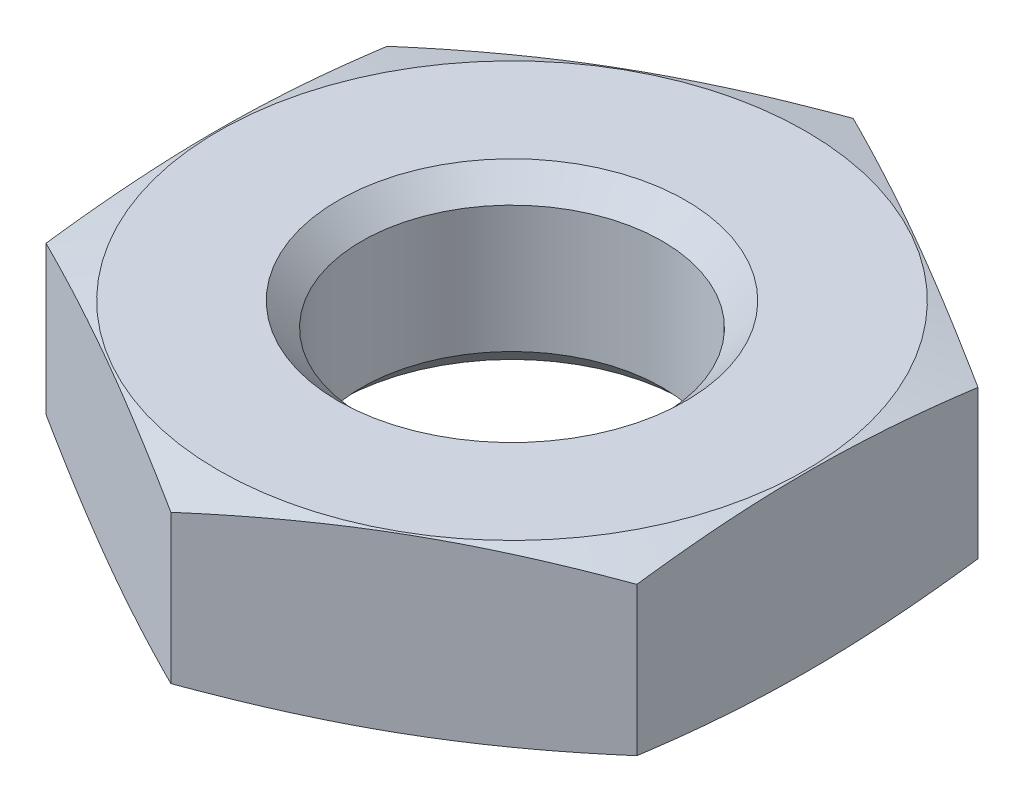
ISO-10303-21;
HEADER;
FILE_DESCRIPTION(('STEP AP214'),'2;1');
FILE_NAME('part.step','',(''),(''),'','','');
FILE_SCHEMA(('AUTOMOTIVE_DESIGN { 1 0 10303 214 1 1 1 1 }'));
ENDSEC;
DATA;
#1=APPLICATION_CONTEXT('core data for automotive mechanical design processes');
#2=APPLICATION_PROTOCOL_DEFINITION('international standard','automotive_design',2000,#1);
#3=PRODUCT_CONTEXT('',#1,'mechanical');
#4=PRODUCT('Part','Part','',(#3));
#5=PRODUCT_RELATED_PRODUCT_CATEGORY('part','',(#4));
#6=PRODUCT_DEFINITION_FORMATION('','',#4);
#7=PRODUCT_DEFINITION_CONTEXT('part definition',#1,'design');
#8=PRODUCT_DEFINITION('design','',#6,#7);
#9=PRODUCT_DEFINITION_SHAPE('','',#8);
#10=(LENGTH_UNIT() NAMED_UNIT(*) SI_UNIT(.MILLI.,.METRE.));
#11=(NAMED_UNIT(*) PLANE_ANGLE_UNIT() SI_UNIT($,.RADIAN.));
#12=(NAMED_UNIT(*) SI_UNIT($,.STERADIAN.) SOLID_ANGLE_UNIT());
#13=UNCERTAINTY_MEASURE_WITH_UNIT(LENGTH_MEASURE(1.E-05),#10,'distance_accuracy_value','');
#14=(GEOMETRIC_REPRESENTATION_CONTEXT(3) GLOBAL_UNCERTAINTY_ASSIGNED_CONTEXT((#13)) GLOBAL_UNIT_ASSIGNED_CONTEXT((#10,
#11,#12)) REPRESENTATION_CONTEXT('',''));
#15=CARTESIAN_POINT('',(0.,0.,0.));
#16=DIRECTION('',(0.,0.,1.));
#17=DIRECTION('',(1.,0.,0.));
#18=AXIS2_PLACEMENT_3D('',#15,#16,#17);
#19=CARTESIAN_POINT('',(0.,0.,0.));
#20=DIRECTION('',(0.,1.,0.));
#21=DIRECTION('',(0.,0.,1.));
#22=AXIS2_PLACEMENT_3D('',#19,#20,#21);
#23=PLANE('',#22);
#24=CARTESIAN_POINT('',(0.,0.,0.));
#25=DIRECTION('',(0.,1.,0.));
#26=DIRECTION('',(0.,0.,1.));
#27=AXIS2_PLACEMENT_3D('',#24,#25,#26);
#28=CIRCLE('',#27,5.);
#29=CARTESIAN_POINT('',(0.,0.,5.));
#30=VERTEX_POINT('',#29);
#31=EDGE_CURVE('E104',#30,#30,#28,.T.);
#32=ORIENTED_EDGE('',*,*,#31,.F.);
#33=EDGE_LOOP('',(#32));
#34=FACE_BOUND('',#33,.T.);
#35=CARTESIAN_POINT('',(0.,0.,0.));
#36=DIRECTION('',(0.,-1.,0.));
#37=DIRECTION('',(0.,0.,-1.));
#38=AXIS2_PLACEMENT_3D('',#35,#36,#37);
#39=CIRCLE('',#38,8.45);
#40=CARTESIAN_POINT('',(0.,0.,-8.45));
#41=VERTEX_POINT('',#40);
#42=EDGE_CURVE('E95',#41,#41,#39,.T.);
#43=ORIENTED_EDGE('',*,*,#42,.F.);
#44=EDGE_LOOP('',(#43));
#45=FACE_BOUND('',#44,.T.);
#46=ADVANCED_FACE('F35',(#34,#45),#23,.T.);
#47=CARTESIAN_POINT('',(0.,-2.5,0.));
#48=DIRECTION('',(0.,-1.,0.));
#49=DIRECTION('',(0.,0.,-1.));
#50=AXIS2_PLACEMENT_3D('',#47,#48,#49);
#51=CONICAL_SURFACE('',#50,17.7801270189222,1.30899693899575);
#52=CARTESIAN_POINT('',(-8.5,-2.36392475448706,15.0360203576042));
#53=CARTESIAN_POINT('',(-8.5,-2.27937012825229,14.6734757623122));
#54=CARTESIAN_POINT('',(-8.5,-2.1954964679628,14.3107707804529));
#55=CARTESIAN_POINT('',(-8.5,-2.02942087737857,13.5849725191365));
#56=CARTESIAN_POINT('',(-8.5,-1.94721897348248,13.2218792336429));
#57=CARTESIAN_POINT('',(-8.5,-1.78478445296958,12.4951814894489));
#58=CARTESIAN_POINT('',(-8.5,-1.70455220114444,12.1315769490498));
#59=CARTESIAN_POINT('',(-8.5,-1.54648067543349,11.4038483267946));
#60=CARTESIAN_POINT('',(-8.5,-1.46864139395056,11.0397242465918));
#61=CARTESIAN_POINT('',(-8.5,-1.31511895411881,10.3073340320132));
#62=CARTESIAN_POINT('',(-8.5,-1.23946401682461,9.93906196641486));
#63=CARTESIAN_POINT('',(-8.5,-1.09175910745214,9.20179613896369));
#64=CARTESIAN_POINT('',(-8.5,-1.01970910749611,8.83280238271482));
#65=CARTESIAN_POINT('',(-8.5,-0.880018719786794,8.09393326140465));
#66=CARTESIAN_POINT('',(-8.5,-0.812378843490313,7.72405779922675));
#67=CARTESIAN_POINT('',(-8.5,-0.682524066993277,6.98335024552976));
#68=CARTESIAN_POINT('',(-8.5,-0.620309164849632,6.61251815435337));
#69=CARTESIAN_POINT('',(-8.5,-0.504138928739045,5.87997045960097));
#70=CARTESIAN_POINT('',(-8.5,-0.450003961095081,5.51828353942055));
#71=CARTESIAN_POINT('',(-8.5,-0.349330847237726,4.79384411222867));
#72=CARTESIAN_POINT('',(-8.5,-0.302792702235554,4.43109160504734));
#73=CARTESIAN_POINT('',(-8.5,-0.218765094679598,3.70462077137004));
#74=CARTESIAN_POINT('',(-8.5,-0.181273351458897,3.34090271172374));
#75=CARTESIAN_POINT('',(-8.5,-0.116770610619291,2.61254160313836));
#76=CARTESIAN_POINT('',(-8.5,-0.0897591451929571,2.24789859621758));
#77=CARTESIAN_POINT('',(-8.5,-0.0475541537350248,1.51956392735028));
#78=CARTESIAN_POINT('',(-8.5,-0.0323080208991868,1.15587536295007));
#79=CARTESIAN_POINT('',(-8.5,-0.0142192230736948,0.428186648910928));
#80=CARTESIAN_POINT('',(-8.5,-0.0113764882642163,0.0641865010374593));
#81=CARTESIAN_POINT('',(-8.5,-0.0182502334673571,-0.66371826942317));
#82=CARTESIAN_POINT('',(-8.5,-0.0279675543871846,-1.02762288398272));
#83=CARTESIAN_POINT('',(-8.5,-0.059441043017621,-1.75489855726966));
#84=CARTESIAN_POINT('',(-8.5,-0.081197199136429,-2.11826961651045));
#85=CARTESIAN_POINT('',(-8.5,-0.147829156542604,-3.00566017974475));
#86=CARTESIAN_POINT('',(-8.5,-0.198684495580304,-3.52923079842504));
#87=CARTESIAN_POINT('',(-8.5,-0.319137315402581,-4.5741303209225));
#88=CARTESIAN_POINT('',(-8.5,-0.388734306057171,-5.0954592830011));
#89=CARTESIAN_POINT('',(-8.5,-0.542670339854262,-6.13767893630393));
#90=CARTESIAN_POINT('',(-8.5,-0.627057752776333,-6.6585623732851));
#91=CARTESIAN_POINT('',(-8.5,-0.806830622464414,-7.69839836943751));
#92=CARTESIAN_POINT('',(-8.5,-0.902215961406582,-8.2173509492331));
#93=CARTESIAN_POINT('',(-8.5,-1.10332786619334,-9.26458573455645));
#94=CARTESIAN_POINT('',(-8.5,-1.20923006614951,-9.79283394970206));
#95=CARTESIAN_POINT('',(-8.5,-1.427471790458,-10.8479976028116));
#96=CARTESIAN_POINT('',(-8.5,-1.53981139317669,-11.374913024469));
#97=CARTESIAN_POINT('',(-8.5,-1.76871242996658,-12.4246853211046));
#98=CARTESIAN_POINT('',(-8.5,-1.88524623727981,-12.9475482412081));
#99=CARTESIAN_POINT('',(-8.5,-2.06282540366483,-13.731191389182));
#100=CARTESIAN_POINT('',(-8.5,-2.12247945448444,-13.9922883452165));
#101=CARTESIAN_POINT('',(-8.5,-2.24261068480916,-14.5142916127147));
#102=CARTESIAN_POINT('',(-8.5,-2.30308786050584,-14.7751979250546));
#103=CARTESIAN_POINT('',(-8.5,-2.36392475448706,-15.0360203576041));
#104=B_SPLINE_CURVE_WITH_KNOTS('',3,(#52,#53,#54,#55,#56,#57,#58,#59,#60,#61,#62,#63,#64,#65,
#66,#67,#68,#69,#70,#71,#72,#73,#74,#75,#76,#77,#78,#79,#80,#81,#82,#83,#84,#85,#86,#87,#88,#89,
#90,#91,#92,#93,#94,#95,#96,#97,#98,#99,#100,#101,#102,#103),.UNSPECIFIED.,.F.,.F.,(4,2,2,2,2,2,
2,2,2,2,2,2,2,2,2,2,2,2,2,2,2,2,2,2,2,4),(0.,1.11682417611697,2.23366597429917,3.35071308134477,
4.46775664166398,5.59563027187189,6.72349517864315,7.85149065587534,8.9794857290864,
10.0765667669557,11.173647979741,12.270452320321,13.3672076972881,14.4590302277838,
15.5508466123061,16.6427360987194,17.7346245337899,19.3122750761973,20.8898843640359,
22.472752670425,24.0556040206808,25.6718286623337,27.2880729834416,28.8951304493105,
29.6986044141634,30.5020746627874),.UNSPECIFIED.);
#105=CARTESIAN_POINT('',(-8.5,-0.365738476404289,4.90747728811182));
#106=VERTEX_POINT('',#105);
#107=CARTESIAN_POINT('',(-8.5,-0.365738476404289,-4.90747728811182));
#108=VERTEX_POINT('',#107);
#109=EDGE_CURVE('E102',#106,#108,#104,.T.);
#110=ORIENTED_EDGE('',*,*,#109,.F.);
#111=CARTESIAN_POINT('',(0.000200000000000405,-0.365769417057962,9.81507004627748));
#112=CARTESIAN_POINT('',(-0.352800229244585,-0.311137500905049,9.61126526889912));
#113=CARTESIAN_POINT('',(-0.706440481475503,-0.261540764749277,9.40709097407731));
#114=CARTESIAN_POINT('',(-1.41496987394528,-0.174403984325095,8.99802133860612));
#115=CARTESIAN_POINT('',(-1.76985946244938,-0.136868837078639,8.79312573915069));
#116=CARTESIAN_POINT('',(-2.47873586595203,-0.0760464794968324,8.38385575676626));
#117=CARTESIAN_POINT('',(-2.83271788769515,-0.0526867370573337,8.17948414122458));
#118=CARTESIAN_POINT('',(-3.5411333400369,-0.0213637164939999,7.77048028911698));
#119=CARTESIAN_POINT('',(-3.89556667001845,-0.0133974596215572,7.56584811064236));
#120=CARTESIAN_POINT('',(-4.60443332998155,-0.0133974596215574,7.15658375369311));
#121=CARTESIAN_POINT('',(-4.9588666599631,-0.0213637164940003,6.95195157521848));
#122=CARTESIAN_POINT('',(-5.66728211230485,-0.0526867370573336,6.54294772311088));
#123=CARTESIAN_POINT('',(-6.02126413404797,-0.0760464794968317,6.33857610756921));
#124=CARTESIAN_POINT('',(-6.73014053755062,-0.136868837078638,5.92930612518478));
#125=CARTESIAN_POINT('',(-7.08503012605472,-0.174403984325094,5.72441052572934));
#126=CARTESIAN_POINT('',(-7.7935595185245,-0.261540764749277,5.31534089025815));
#127=CARTESIAN_POINT('',(-8.14719977075542,-0.311137500905049,5.11116659543634));
#128=CARTESIAN_POINT('',(-8.5002,-0.365769417057961,4.90736181805798));
#129=B_SPLINE_CURVE_WITH_KNOTS('',3,(#111,#112,#113,#114,#115,#116,#117,#118,#119,#120,#121,
#122,#123,#124,#125,#126,#127,#128),.UNSPECIFIED.,.F.,.F.,(4,2,2,2,2,2,2,2,4),(0.,
1.23382789118024,2.46815608714628,3.69611406802288,4.92383440651826,6.15155474501364,
7.37951272589024,8.61384092185628,9.84766881303653),.UNSPECIFIED.);
#130=CARTESIAN_POINT('',(0.,-0.365738476404289,9.81495457622364));
#131=VERTEX_POINT('',#130);
#132=EDGE_CURVE('E139',#131,#106,#129,.T.);
#133=ORIENTED_EDGE('',*,*,#132,.F.);
#134=CARTESIAN_POINT('',(8.5002,-0.365769417057961,4.90736181805798));
#135=CARTESIAN_POINT('',(8.14719977075542,-0.311137500905049,5.11116659543634));
#136=CARTESIAN_POINT('',(7.7935595185245,-0.261540764749276,5.31534089025815));
#137=CARTESIAN_POINT('',(7.08503012605472,-0.174403984325094,5.72441052572934));
#138=CARTESIAN_POINT('',(6.73014053755062,-0.136868837078638,5.92930612518477));
#139=CARTESIAN_POINT('',(6.02126413404797,-0.0760464794968321,6.3385761075692));
#140=CARTESIAN_POINT('',(5.66728211230485,-0.0526867370573339,6.54294772311088));
#141=CARTESIAN_POINT('',(4.9588666599631,-0.021363716494,6.95195157521848));
#142=CARTESIAN_POINT('',(4.60443332998155,-0.0133974596215567,7.15658375369311));
#143=CARTESIAN_POINT('',(3.89556667001845,-0.0133974596215566,7.56584811064235));
#144=CARTESIAN_POINT('',(3.5411333400369,-0.0213637164939999,7.77048028911698));
#145=CARTESIAN_POINT('',(2.83271788769515,-0.0526867370573339,8.17948414122458));
#146=CARTESIAN_POINT('',(2.47873586595203,-0.0760464794968322,8.38385575676626));
#147=CARTESIAN_POINT('',(1.76985946244938,-0.136868837078639,8.79312573915068));
#148=CARTESIAN_POINT('',(1.41496987394528,-0.174403984325095,8.99802133860612));
#149=CARTESIAN_POINT('',(0.706440481475504,-0.261540764749277,9.40709097407731));
#150=CARTESIAN_POINT('',(0.352800229244586,-0.311137500905049,9.61126526889912));
#151=CARTESIAN_POINT('',(-0.000200000000000203,-0.365769417057962,9.81507004627748));
#152=B_SPLINE_CURVE_WITH_KNOTS('',3,(#134,#135,#136,#137,#138,#139,#140,#141,#142,#143,#144,
#145,#146,#147,#148,#149,#150,#151),.UNSPECIFIED.,.F.,.F.,(4,2,2,2,2,2,2,2,4),(0.,
1.23382789118024,2.46815608714628,3.69611406802288,4.92383440651826,6.15155474501364,
7.37951272589024,8.61384092185628,9.84766881303653),.UNSPECIFIED.);
#153=CARTESIAN_POINT('',(8.5,-0.365738476404289,4.90747728811182));
#154=VERTEX_POINT('',#153);
#155=EDGE_CURVE('E146',#154,#131,#152,.T.);
#156=ORIENTED_EDGE('',*,*,#155,.F.);
#157=CARTESIAN_POINT('',(8.5,-2.36392475448706,-15.0360203576042));
#158=CARTESIAN_POINT('',(8.5,-2.27937012825229,-14.6734757623122));
#159=CARTESIAN_POINT('',(8.5,-2.1954964679628,-14.3107707804529));
#160=CARTESIAN_POINT('',(8.5,-2.02942087737857,-13.5849725191365));
#161=CARTESIAN_POINT('',(8.5,-1.94721897348248,-13.2218792336429));
#162=CARTESIAN_POINT('',(8.5,-1.78478445296958,-12.4951814894489));
#163=CARTESIAN_POINT('',(8.5,-1.70455220114444,-12.1315769490498));
#164=CARTESIAN_POINT('',(8.5,-1.54648067543349,-11.4038483267946));
#165=CARTESIAN_POINT('',(8.5,-1.46864139395056,-11.0397242465918));
#166=CARTESIAN_POINT('',(8.5,-1.31511895411881,-10.3073340320132));
#167=CARTESIAN_POINT('',(8.5,-1.23946401682461,-9.93906196641486));
#168=CARTESIAN_POINT('',(8.5,-1.09175910745214,-9.20179613896369));
#169=CARTESIAN_POINT('',(8.5,-1.01970910749611,-8.83280238271482));
#170=CARTESIAN_POINT('',(8.5,-0.880018719786794,-8.09393326140465));
#171=CARTESIAN_POINT('',(8.5,-0.812378843490313,-7.72405779922675));
#172=CARTESIAN_POINT('',(8.5,-0.682524066993277,-6.98335024552976));
#173=CARTESIAN_POINT('',(8.5,-0.620309164849632,-6.61251815435337));
#174=CARTESIAN_POINT('',(8.5,-0.504138928739045,-5.87997045960097));
#175=CARTESIAN_POINT('',(8.5,-0.450003961095081,-5.51828353942055));
#176=CARTESIAN_POINT('',(8.5,-0.349330847237726,-4.79384411222867));
#177=CARTESIAN_POINT('',(8.5,-0.302792702235554,-4.43109160504734));
#178=CARTESIAN_POINT('',(8.5,-0.218765094679598,-3.70462077137004));
#179=CARTESIAN_POINT('',(8.5,-0.181273351458897,-3.34090271172374));
#180=CARTESIAN_POINT('',(8.5,-0.116770610619291,-2.61254160313836));
#181=CARTESIAN_POINT('',(8.5,-0.0897591451929571,-2.24789859621758));
#182=CARTESIAN_POINT('',(8.5,-0.0475541537350248,-1.51956392735028));
#183=CARTESIAN_POINT('',(8.5,-0.0323080208991868,-1.15587536295007));
#184=CARTESIAN_POINT('',(8.5,-0.0142192230736948,-0.428186648910928));
#185=CARTESIAN_POINT('',(8.5,-0.0113764882642163,-0.0641865010374593));
#186=CARTESIAN_POINT('',(8.5,-0.0182502334673571,0.66371826942317));
#187=CARTESIAN_POINT('',(8.5,-0.0279675543871846,1.02762288398272));
#188=CARTESIAN_POINT('',(8.5,-0.059441043017621,1.75489855726966));
#189=CARTESIAN_POINT('',(8.5,-0.081197199136429,2.11826961651045));
#190=CARTESIAN_POINT('',(8.5,-0.147829156542604,3.00566017974475));
#191=CARTESIAN_POINT('',(8.5,-0.198684495580304,3.52923079842504));
#192=CARTESIAN_POINT('',(8.5,-0.319137315402581,4.5741303209225));
#193=CARTESIAN_POINT('',(8.5,-0.388734306057171,5.0954592830011));
#194=CARTESIAN_POINT('',(8.5,-0.542670339854262,6.13767893630393));
#195=CARTESIAN_POINT('',(8.5,-0.627057752776333,6.6585623732851));
#196=CARTESIAN_POINT('',(8.5,-0.806830622464414,7.69839836943751));
#197=CARTESIAN_POINT('',(8.5,-0.902215961406582,8.2173509492331));
#198=CARTESIAN_POINT('',(8.5,-1.10332786619334,9.26458573455645));
#199=CARTESIAN_POINT('',(8.5,-1.20923006614951,9.79283394970206));
#200=CARTESIAN_POINT('',(8.5,-1.427471790458,10.8479976028116));
#201=CARTESIAN_POINT('',(8.5,-1.53981139317669,11.374913024469));
#202=CARTESIAN_POINT('',(8.5,-1.76871242996658,12.4246853211046));
#203=CARTESIAN_POINT('',(8.5,-1.88524623727981,12.9475482412081));
#204=CARTESIAN_POINT('',(8.5,-2.06282540366483,13.731191389182));
#205=CARTESIAN_POINT('',(8.5,-2.12247945448444,13.9922883452165));
#206=CARTESIAN_POINT('',(8.5,-2.24261068480916,14.5142916127147));
#207=CARTESIAN_POINT('',(8.5,-2.30308786050584,14.7751979250546));
#208=CARTESIAN_POINT('',(8.5,-2.36392475448706,15.0360203576041));
#209=B_SPLINE_CURVE_WITH_KNOTS('',3,(#157,#158,#159,#160,#161,#162,#163,#164,#165,#166,#167,
#168,#169,#170,#171,#172,#173,#174,#175,#176,#177,#178,#179,#180,#181,#182,#183,#184,#185,#186,
#187,#188,#189,#190,#191,#192,#193,#194,#195,#196,#197,#198,#199,#200,#201,#202,#203,#204,#205,
#206,#207,#208),.UNSPECIFIED.,.F.,.F.,(4,2,2,2,2,2,2,2,2,2,2,2,2,2,2,2,2,2,2,2,2,2,2,2,2,4),(0.,
1.11682417611697,2.23366597429917,3.35071308134477,4.46775664166398,5.59563027187189,
6.72349517864315,7.85149065587534,8.9794857290864,10.0765667669557,11.173647979741,
12.270452320321,13.3672076972881,14.4590302277838,15.5508466123061,16.6427360987194,
17.7346245337899,19.3122750761973,20.8898843640359,22.472752670425,24.0556040206808,
25.6718286623337,27.2880729834416,28.8951304493105,29.6986044141634,30.5020746627874),.UNSPECIFIED.);
#210=CARTESIAN_POINT('',(8.5,-0.365738476404289,-4.90747728811182));
#211=VERTEX_POINT('',#210);
#212=EDGE_CURVE('E181',#211,#154,#209,.T.);
#213=ORIENTED_EDGE('',*,*,#212,.F.);
#214=CARTESIAN_POINT('',(-0.000200000000000405,-0.365769417057962,-9.81507004627748));
#215=CARTESIAN_POINT('',(0.352800229244585,-0.311137500905049,-9.61126526889912));
#216=CARTESIAN_POINT('',(0.706440481475503,-0.261540764749277,-9.40709097407731));
#217=CARTESIAN_POINT('',(1.41496987394528,-0.174403984325095,-8.99802133860612));
#218=CARTESIAN_POINT('',(1.76985946244938,-0.136868837078639,-8.79312573915069));
#219=CARTESIAN_POINT('',(2.47873586595203,-0.0760464794968324,-8.38385575676626));
#220=CARTESIAN_POINT('',(2.83271788769515,-0.0526867370573337,-8.17948414122458));
#221=CARTESIAN_POINT('',(3.5411333400369,-0.0213637164939999,-7.77048028911698));
#222=CARTESIAN_POINT('',(3.89556667001845,-0.0133974596215572,-7.56584811064236));
#223=CARTESIAN_POINT('',(4.60443332998155,-0.0133974596215574,-7.15658375369311));
#224=CARTESIAN_POINT('',(4.9588666599631,-0.0213637164940003,-6.95195157521848));
#225=CARTESIAN_POINT('',(5.66728211230485,-0.0526867370573336,-6.54294772311088));
#226=CARTESIAN_POINT('',(6.02126413404797,-0.0760464794968317,-6.33857610756921));
#227=CARTESIAN_POINT('',(6.73014053755062,-0.136868837078638,-5.92930612518478));
#228=CARTESIAN_POINT('',(7.08503012605472,-0.174403984325094,-5.72441052572934));
#229=CARTESIAN_POINT('',(7.7935595185245,-0.261540764749277,-5.31534089025815));
#230=CARTESIAN_POINT('',(8.14719977075542,-0.311137500905049,-5.11116659543634));
#231=CARTESIAN_POINT('',(8.5002,-0.365769417057961,-4.90736181805798));
#232=B_SPLINE_CURVE_WITH_KNOTS('',3,(#214,#215,#216,#217,#218,#219,#220,#221,#222,#223,#224,
#225,#226,#227,#228,#229,#230,#231),.UNSPECIFIED.,.F.,.F.,(4,2,2,2,2,2,2,2,4),(0.,
1.23382789118024,2.46815608714628,3.69611406802288,4.92383440651826,6.15155474501364,
7.37951272589024,8.61384092185628,9.84766881303653),.UNSPECIFIED.);
#233=CARTESIAN_POINT('',(0.,-0.365738476404289,-9.81495457622364));
#234=VERTEX_POINT('',#233);
#235=EDGE_CURVE('E174',#234,#211,#232,.T.);
#236=ORIENTED_EDGE('',*,*,#235,.F.);
#237=CARTESIAN_POINT('',(-8.5002,-0.365769417057961,-4.90736181805798));
#238=CARTESIAN_POINT('',(-8.14719977075542,-0.311137500905049,-5.11116659543634));
#239=CARTESIAN_POINT('',(-7.7935595185245,-0.261540764749276,-5.31534089025815));
#240=CARTESIAN_POINT('',(-7.08503012605472,-0.174403984325094,-5.72441052572934));
#241=CARTESIAN_POINT('',(-6.73014053755062,-0.136868837078638,-5.92930612518477));
#242=CARTESIAN_POINT('',(-6.02126413404797,-0.0760464794968321,-6.3385761075692));
#243=CARTESIAN_POINT('',(-5.66728211230485,-0.0526867370573339,-6.54294772311088));
#244=CARTESIAN_POINT('',(-4.9588666599631,-0.021363716494,-6.95195157521848));
#245=CARTESIAN_POINT('',(-4.60443332998155,-0.0133974596215567,-7.15658375369311));
#246=CARTESIAN_POINT('',(-3.89556667001845,-0.0133974596215566,-7.56584811064235));
#247=CARTESIAN_POINT('',(-3.5411333400369,-0.0213637164939999,-7.77048028911698));
#248=CARTESIAN_POINT('',(-2.83271788769515,-0.0526867370573339,-8.17948414122458));
#249=CARTESIAN_POINT('',(-2.47873586595203,-0.0760464794968322,-8.38385575676626));
#250=CARTESIAN_POINT('',(-1.76985946244938,-0.136868837078639,-8.79312573915068));
#251=CARTESIAN_POINT('',(-1.41496987394528,-0.174403984325095,-8.99802133860612));
#252=CARTESIAN_POINT('',(-0.706440481475504,-0.261540764749277,-9.40709097407731));
#253=CARTESIAN_POINT('',(-0.352800229244586,-0.311137500905049,-9.61126526889912));
#254=CARTESIAN_POINT('',(0.000200000000000203,-0.365769417057962,-9.81507004627748));
#255=B_SPLINE_CURVE_WITH_KNOTS('',3,(#237,#238,#239,#240,#241,#242,#243,#244,#245,#246,#247,
#248,#249,#250,#251,#252,#253,#254),.UNSPECIFIED.,.F.,.F.,(4,2,2,2,2,2,2,2,4),(0.,
1.23382789118024,2.46815608714628,3.69611406802288,4.92383440651826,6.15155474501364,
7.37951272589024,8.61384092185628,9.84766881303653),.UNSPECIFIED.);
#256=EDGE_CURVE('E164',#108,#234,#255,.T.);
#257=ORIENTED_EDGE('',*,*,#256,.F.);
#258=EDGE_LOOP('',(#110,#133,#156,#213,#236,#257));
#259=FACE_BOUND('',#258,.T.);
#260=ORIENTED_EDGE('',*,*,#42,.T.);
#261=EDGE_LOOP('',(#260));
#262=FACE_BOUND('',#261,.T.);
#263=ADVANCED_FACE('F157',(#259,#262),#51,.T.);
#264=CARTESIAN_POINT('',(-8.5,6.,-4.90747728811182));
#265=DIRECTION('',(1.,0.,0.));
#266=DIRECTION('',(0.,0.,-1.));
#267=AXIS2_PLACEMENT_3D('',#264,#265,#266);
#268=PLANE('',#267);
#269=ORIENTED_EDGE('',*,*,#109,.T.);
#270=DIRECTION('',(0.,-1.,0.));
#271=VECTOR('',#270,1.);
#272=CARTESIAN_POINT('',(-8.5,6.,-4.90747728811182));
#273=LINE('',#272,#271);
#274=CARTESIAN_POINT('',(-8.5,-4.63426152359571,-4.90747728811182));
#275=VERTEX_POINT('',#274);
#276=EDGE_CURVE('E55',#108,#275,#273,.T.);
#277=ORIENTED_EDGE('',*,*,#276,.T.);
#278=CARTESIAN_POINT('',(-8.5,-2.63607524551294,-15.0360203576042));
#279=CARTESIAN_POINT('',(-8.5,-2.72062987174771,-14.6734757623122));
#280=CARTESIAN_POINT('',(-8.5,-2.8045035320372,-14.3107707804529));
#281=CARTESIAN_POINT('',(-8.5,-2.97057912262143,-13.5849725191365));
#282=CARTESIAN_POINT('',(-8.5,-3.05278102651752,-13.2218792336429));
#283=CARTESIAN_POINT('',(-8.5,-3.21521554703042,-12.4951814894489));
#284=CARTESIAN_POINT('',(-8.5,-3.29544779885556,-12.1315769490498));
#285=CARTESIAN_POINT('',(-8.5,-3.45351932456651,-11.4038483267946));
#286=CARTESIAN_POINT('',(-8.5,-3.53135860604944,-11.0397242465918));
#287=CARTESIAN_POINT('',(-8.5,-3.68488104588119,-10.3073340320132));
#288=CARTESIAN_POINT('',(-8.5,-3.76053598317539,-9.93906196641486));
#289=CARTESIAN_POINT('',(-8.5,-3.90824089254787,-9.20179613896369));
#290=CARTESIAN_POINT('',(-8.5,-3.98029089250389,-8.83280238271482));
#291=CARTESIAN_POINT('',(-8.5,-4.1199812802132,-8.09393326140466));
#292=CARTESIAN_POINT('',(-8.5,-4.18762115650969,-7.72405779922675));
#293=CARTESIAN_POINT('',(-8.5,-4.31747593300672,-6.98335024552976));
#294=CARTESIAN_POINT('',(-8.5,-4.37969083515037,-6.61251815435337));
#295=CARTESIAN_POINT('',(-8.5,-4.49586107126096,-5.87997045960097));
#296=CARTESIAN_POINT('',(-8.5,-4.54999603890492,-5.51828353942055));
#297=CARTESIAN_POINT('',(-8.5,-4.65066915276227,-4.79384411222867));
#298=CARTESIAN_POINT('',(-8.5,-4.69720729776445,-4.43109160504734));
#299=CARTESIAN_POINT('',(-8.5,-4.7812349053204,-3.70462077137004));
#300=CARTESIAN_POINT('',(-8.5,-4.8187266485411,-3.34090271172374));
#301=CARTESIAN_POINT('',(-8.5,-4.88322938938071,-2.61254160313836));
#302=CARTESIAN_POINT('',(-8.5,-4.91024085480704,-2.24789859621759));
#303=CARTESIAN_POINT('',(-8.5,-4.95244584626498,-1.51956392735028));
#304=CARTESIAN_POINT('',(-8.5,-4.96769197910081,-1.15587536295007));
#305=CARTESIAN_POINT('',(-8.5,-4.98578077692631,-0.428186648910928));
#306=CARTESIAN_POINT('',(-8.5,-4.98862351173578,-0.0641865010374597));
#307=CARTESIAN_POINT('',(-8.5,-4.98174976653264,0.66371826942317));
#308=CARTESIAN_POINT('',(-8.5,-4.97203244561282,1.02762288398272));
#309=CARTESIAN_POINT('',(-8.5,-4.94055895698238,1.75489855726966));
#310=CARTESIAN_POINT('',(-8.5,-4.91880280086357,2.11826961651045));
#311=CARTESIAN_POINT('',(-8.5,-4.8521708434574,3.00566017974475));
#312=CARTESIAN_POINT('',(-8.5,-4.8013155044197,3.52923079842504));
#313=CARTESIAN_POINT('',(-8.5,-4.68086268459742,4.5741303209225));
#314=CARTESIAN_POINT('',(-8.5,-4.61126569394283,5.0954592830011));
#315=CARTESIAN_POINT('',(-8.5,-4.45732966014574,6.13767893630393));
#316=CARTESIAN_POINT('',(-8.5,-4.37294224722367,6.6585623732851));
#317=CARTESIAN_POINT('',(-8.5,-4.19316937753559,7.69839836943752));
#318=CARTESIAN_POINT('',(-8.5,-4.09778403859342,8.2173509492331));
#319=CARTESIAN_POINT('',(-8.5,-3.89667213380666,9.26458573455645));
#320=CARTESIAN_POINT('',(-8.5,-3.79076993385049,9.79283394970206));
#321=CARTESIAN_POINT('',(-8.5,-3.572528209542,10.8479976028116));
#322=CARTESIAN_POINT('',(-8.5,-3.46018860682331,11.374913024469));
#323=CARTESIAN_POINT('',(-8.5,-3.23128757003342,12.4246853211046));
#324=CARTESIAN_POINT('',(-8.5,-3.11475376272019,12.9475482412081));
#325=CARTESIAN_POINT('',(-8.5,-2.93717459633517,13.731191389182));
#326=CARTESIAN_POINT('',(-8.5,-2.87752054551556,13.9922883452165));
#327=CARTESIAN_POINT('',(-8.5,-2.75738931519084,14.5142916127147));
#328=CARTESIAN_POINT('',(-8.5,-2.69691213949416,14.7751979250546));
#329=CARTESIAN_POINT('',(-8.5,-2.63607524551294,15.0360203576041));
#330=B_SPLINE_CURVE_WITH_KNOTS('',3,(#278,#279,#280,#281,#282,#283,#284,#285,#286,#287,#288,
#289,#290,#291,#292,#293,#294,#295,#296,#297,#298,#299,#300,#301,#302,#303,#304,#305,#306,#307,
#308,#309,#310,#311,#312,#313,#314,#315,#316,#317,#318,#319,#320,#321,#322,#323,#324,#325,#326,
#327,#328,#329),.UNSPECIFIED.,.F.,.F.,(4,2,2,2,2,2,2,2,2,2,2,2,2,2,2,2,2,2,2,2,2,2,2,2,2,4),(0.,
1.11682417611697,2.23366597429917,3.35071308134477,4.46775664166398,5.59563027187189,
6.72349517864315,7.85149065587534,8.9794857290864,10.0765667669557,11.173647979741,
12.270452320321,13.3672076972881,14.4590302277838,15.5508466123061,16.6427360987194,
17.7346245337899,19.3122750761973,20.8898843640359,22.472752670425,24.0556040206808,
25.6718286623337,27.2880729834416,28.8951304493105,29.6986044141634,30.5020746627874),.UNSPECIFIED.);
#331=CARTESIAN_POINT('',(-8.5,-4.63426152359571,4.90747728811182));
#332=VERTEX_POINT('',#331);
#333=EDGE_CURVE('E11',#275,#332,#330,.T.);
#334=ORIENTED_EDGE('',*,*,#333,.T.);
#335=DIRECTION('',(0.,-1.,0.));
#336=VECTOR('',#335,1.);
#337=CARTESIAN_POINT('',(-8.5,6.,4.90747728811182));
#338=LINE('',#337,#336);
#339=EDGE_CURVE('E267',#106,#332,#338,.T.);
#340=ORIENTED_EDGE('',*,*,#339,.F.);
#341=EDGE_LOOP('',(#269,#277,#334,#340));
#342=FACE_BOUND('',#341,.T.);
#343=ADVANCED_FACE('F98',(#342),#268,.F.);
#344=CARTESIAN_POINT('',(-8.5,6.,4.90747728811182));
#345=DIRECTION('',(0.5,0.,-0.866025403784438));
#346=DIRECTION('',(-0.866025403784439,0.,-0.5));
#347=AXIS2_PLACEMENT_3D('',#344,#345,#346);
#348=PLANE('',#347);
#349=ORIENTED_EDGE('',*,*,#132,.T.);
#350=ORIENTED_EDGE('',*,*,#339,.T.);
#351=CARTESIAN_POINT('',(-8.5002,-4.63423058294204,4.90736181805798));
#352=CARTESIAN_POINT('',(-8.14719977075542,-4.68886249909495,5.11116659543634));
#353=CARTESIAN_POINT('',(-7.7935595185245,-4.73845923525072,5.31534089025815));
#354=CARTESIAN_POINT('',(-7.08503012605472,-4.82559601567491,5.72441052572934));
#355=CARTESIAN_POINT('',(-6.73014053755062,-4.86313116292136,5.92930612518478));
#356=CARTESIAN_POINT('',(-6.02126413404797,-4.92395352050317,6.33857610756921));
#357=CARTESIAN_POINT('',(-5.66728211230485,-4.94731326294267,6.54294772311088));
#358=CARTESIAN_POINT('',(-4.9588666599631,-4.978636283506,6.95195157521848));
#359=CARTESIAN_POINT('',(-4.60443332998155,-4.98660254037844,7.15658375369311));
#360=CARTESIAN_POINT('',(-3.89556667001845,-4.98660254037844,7.56584811064236));
#361=CARTESIAN_POINT('',(-3.5411333400369,-4.978636283506,7.77048028911698));
#362=CARTESIAN_POINT('',(-2.83271788769515,-4.94731326294267,8.17948414122458));
#363=CARTESIAN_POINT('',(-2.47873586595203,-4.92395352050317,8.38385575676626));
#364=CARTESIAN_POINT('',(-1.76985946244938,-4.86313116292136,8.79312573915069));
#365=CARTESIAN_POINT('',(-1.41496987394528,-4.82559601567491,8.99802133860612));
#366=CARTESIAN_POINT('',(-0.706440481475502,-4.73845923525072,9.40709097407731));
#367=CARTESIAN_POINT('',(-0.352800229244585,-4.68886249909495,9.61126526889912));
#368=CARTESIAN_POINT('',(0.000200000000001252,-4.63423058294204,9.81507004627748));
#369=B_SPLINE_CURVE_WITH_KNOTS('',3,(#351,#352,#353,#354,#355,#356,#357,#358,#359,#360,#361,
#362,#363,#364,#365,#366,#367,#368),.UNSPECIFIED.,.F.,.F.,(4,2,2,2,2,2,2,2,4),(0.,
1.23382789118024,2.46815608714628,3.69611406802289,4.92383440651826,6.15155474501364,
7.37951272589024,8.61384092185628,9.84766881303653),.UNSPECIFIED.);
#370=CARTESIAN_POINT('',(0.,-4.63426152359571,9.81495457622364));
#371=VERTEX_POINT('',#370);
#372=EDGE_CURVE('E48',#332,#371,#369,.T.);
#373=ORIENTED_EDGE('',*,*,#372,.T.);
#374=DIRECTION('',(0.,-1.,0.));
#375=VECTOR('',#374,1.);
#376=CARTESIAN_POINT('',(0.,6.,9.81495457622364));
#377=LINE('',#376,#375);
#378=EDGE_CURVE('E266',#131,#371,#377,.T.);
#379=ORIENTED_EDGE('',*,*,#378,.F.);
#380=EDGE_LOOP('',(#349,#350,#373,#379));
#381=FACE_BOUND('',#380,.T.);
#382=ADVANCED_FACE('F130',(#381),#348,.F.);
#383=CARTESIAN_POINT('',(0.,6.,9.81495457622364));
#384=DIRECTION('',(-0.5,0.,-0.866025403784438));
#385=DIRECTION('',(-0.866025403784439,0.,0.5));
#386=AXIS2_PLACEMENT_3D('',#383,#384,#385);
#387=PLANE('',#386);
#388=ORIENTED_EDGE('',*,*,#155,.T.);
#389=ORIENTED_EDGE('',*,*,#378,.T.);
#390=CARTESIAN_POINT('',(-0.00020000000000009,-4.63423058294204,9.81507004627748));
#391=CARTESIAN_POINT('',(0.352800229244587,-4.68886249909495,9.61126526889912));
#392=CARTESIAN_POINT('',(0.706440481475503,-4.73845923525072,9.40709097407731));
#393=CARTESIAN_POINT('',(1.41496987394528,-4.82559601567491,8.99802133860612));
#394=CARTESIAN_POINT('',(1.76985946244938,-4.86313116292136,8.79312573915068));
#395=CARTESIAN_POINT('',(2.47873586595203,-4.92395352050317,8.38385575676626));
#396=CARTESIAN_POINT('',(2.83271788769515,-4.94731326294267,8.17948414122458));
#397=CARTESIAN_POINT('',(3.5411333400369,-4.978636283506,7.77048028911698));
#398=CARTESIAN_POINT('',(3.89556667001845,-4.98660254037844,7.56584811064236));
#399=CARTESIAN_POINT('',(4.60443332998155,-4.98660254037844,7.15658375369311));
#400=CARTESIAN_POINT('',(4.9588666599631,-4.978636283506,6.95195157521848));
#401=CARTESIAN_POINT('',(5.66728211230485,-4.94731326294267,6.54294772311088));
#402=CARTESIAN_POINT('',(6.02126413404797,-4.92395352050317,6.3385761075692));
#403=CARTESIAN_POINT('',(6.73014053755062,-4.86313116292136,5.92930612518477));
#404=CARTESIAN_POINT('',(7.08503012605472,-4.82559601567491,5.72441052572934));
#405=CARTESIAN_POINT('',(7.7935595185245,-4.73845923525072,5.31534089025815));
#406=CARTESIAN_POINT('',(8.14719977075542,-4.68886249909495,5.11116659543634));
#407=CARTESIAN_POINT('',(8.5002,-4.63423058294204,4.90736181805798));
#408=B_SPLINE_CURVE_WITH_KNOTS('',3,(#390,#391,#392,#393,#394,#395,#396,#397,#398,#399,#400,
#401,#402,#403,#404,#405,#406,#407),.UNSPECIFIED.,.F.,.F.,(4,2,2,2,2,2,2,2,4),(0.,
1.23382789118024,2.46815608714628,3.69611406802288,4.92383440651826,6.15155474501364,
7.37951272589024,8.61384092185629,9.84766881303653),.UNSPECIFIED.);
#409=CARTESIAN_POINT('',(8.5,-4.63426152359571,4.90747728811182));
#410=VERTEX_POINT('',#409);
#411=EDGE_CURVE('E111',#371,#410,#408,.T.);
#412=ORIENTED_EDGE('',*,*,#411,.T.);
#413=DIRECTION('',(0.,-1.,0.));
#414=VECTOR('',#413,1.);
#415=CARTESIAN_POINT('',(8.5,6.,4.90747728811182));
#416=LINE('',#415,#414);
#417=EDGE_CURVE('E263',#154,#410,#416,.T.);
#418=ORIENTED_EDGE('',*,*,#417,.F.);
#419=EDGE_LOOP('',(#388,#389,#412,#418));
#420=FACE_BOUND('',#419,.T.);
#421=ADVANCED_FACE('F133',(#420),#387,.F.);
#422=CARTESIAN_POINT('',(8.5,6.,4.90747728811182));
#423=DIRECTION('',(-1.,0.,0.));
#424=DIRECTION('',(0.,0.,1.));
#425=AXIS2_PLACEMENT_3D('',#422,#423,#424);
#426=PLANE('',#425);
#427=ORIENTED_EDGE('',*,*,#212,.T.);
#428=ORIENTED_EDGE('',*,*,#417,.T.);
#429=CARTESIAN_POINT('',(8.5,-2.63607524551294,15.0360203576042));
#430=CARTESIAN_POINT('',(8.5,-2.72062987174771,14.6734757623122));
#431=CARTESIAN_POINT('',(8.5,-2.8045035320372,14.3107707804529));
#432=CARTESIAN_POINT('',(8.5,-2.97057912262143,13.5849725191365));
#433=CARTESIAN_POINT('',(8.5,-3.05278102651752,13.2218792336429));
#434=CARTESIAN_POINT('',(8.5,-3.21521554703042,12.4951814894489));
#435=CARTESIAN_POINT('',(8.5,-3.29544779885556,12.1315769490498));
#436=CARTESIAN_POINT('',(8.5,-3.45351932456651,11.4038483267946));
#437=CARTESIAN_POINT('',(8.5,-3.53135860604944,11.0397242465918));
#438=CARTESIAN_POINT('',(8.5,-3.68488104588119,10.3073340320132));
#439=CARTESIAN_POINT('',(8.5,-3.76053598317539,9.93906196641486));
#440=CARTESIAN_POINT('',(8.5,-3.90824089254787,9.20179613896369));
#441=CARTESIAN_POINT('',(8.5,-3.98029089250389,8.83280238271482));
#442=CARTESIAN_POINT('',(8.5,-4.1199812802132,8.09393326140466));
#443=CARTESIAN_POINT('',(8.5,-4.18762115650969,7.72405779922675));
#444=CARTESIAN_POINT('',(8.5,-4.31747593300672,6.98335024552976));
#445=CARTESIAN_POINT('',(8.5,-4.37969083515037,6.61251815435337));
#446=CARTESIAN_POINT('',(8.5,-4.49586107126096,5.87997045960097));
#447=CARTESIAN_POINT('',(8.5,-4.54999603890492,5.51828353942055));
#448=CARTESIAN_POINT('',(8.5,-4.65066915276227,4.79384411222867));
#449=CARTESIAN_POINT('',(8.5,-4.69720729776445,4.43109160504734));
#450=CARTESIAN_POINT('',(8.5,-4.7812349053204,3.70462077137004));
#451=CARTESIAN_POINT('',(8.5,-4.8187266485411,3.34090271172374));
#452=CARTESIAN_POINT('',(8.5,-4.88322938938071,2.61254160313836));
#453=CARTESIAN_POINT('',(8.5,-4.91024085480704,2.24789859621759));
#454=CARTESIAN_POINT('',(8.5,-4.95244584626498,1.51956392735028));
#455=CARTESIAN_POINT('',(8.5,-4.96769197910081,1.15587536295007));
#456=CARTESIAN_POINT('',(8.5,-4.98578077692631,0.428186648910928));
#457=CARTESIAN_POINT('',(8.5,-4.98862351173578,0.0641865010374597));
#458=CARTESIAN_POINT('',(8.5,-4.98174976653264,-0.66371826942317));
#459=CARTESIAN_POINT('',(8.5,-4.97203244561282,-1.02762288398272));
#460=CARTESIAN_POINT('',(8.5,-4.94055895698238,-1.75489855726966));
#461=CARTESIAN_POINT('',(8.5,-4.91880280086357,-2.11826961651045));
#462=CARTESIAN_POINT('',(8.5,-4.8521708434574,-3.00566017974475));
#463=CARTESIAN_POINT('',(8.5,-4.8013155044197,-3.52923079842504));
#464=CARTESIAN_POINT('',(8.5,-4.68086268459742,-4.5741303209225));
#465=CARTESIAN_POINT('',(8.5,-4.61126569394283,-5.0954592830011));
#466=CARTESIAN_POINT('',(8.5,-4.45732966014574,-6.13767893630393));
#467=CARTESIAN_POINT('',(8.5,-4.37294224722367,-6.6585623732851));
#468=CARTESIAN_POINT('',(8.5,-4.19316937753559,-7.69839836943752));
#469=CARTESIAN_POINT('',(8.5,-4.09778403859342,-8.2173509492331));
#470=CARTESIAN_POINT('',(8.5,-3.89667213380666,-9.26458573455645));
#471=CARTESIAN_POINT('',(8.5,-3.79076993385049,-9.79283394970206));
#472=CARTESIAN_POINT('',(8.5,-3.572528209542,-10.8479976028116));
#473=CARTESIAN_POINT('',(8.5,-3.46018860682331,-11.374913024469));
#474=CARTESIAN_POINT('',(8.5,-3.23128757003342,-12.4246853211046));
#475=CARTESIAN_POINT('',(8.5,-3.11475376272019,-12.9475482412081));
#476=CARTESIAN_POINT('',(8.5,-2.93717459633517,-13.731191389182));
#477=CARTESIAN_POINT('',(8.5,-2.87752054551556,-13.9922883452165));
#478=CARTESIAN_POINT('',(8.5,-2.75738931519084,-14.5142916127147));
#479=CARTESIAN_POINT('',(8.5,-2.69691213949416,-14.7751979250546));
#480=CARTESIAN_POINT('',(8.5,-2.63607524551294,-15.0360203576041));
#481=B_SPLINE_CURVE_WITH_KNOTS('',3,(#429,#430,#431,#432,#433,#434,#435,#436,#437,#438,#439,
#440,#441,#442,#443,#444,#445,#446,#447,#448,#449,#450,#451,#452,#453,#454,#455,#456,#457,#458,
#459,#460,#461,#462,#463,#464,#465,#466,#467,#468,#469,#470,#471,#472,#473,#474,#475,#476,#477,
#478,#479,#480),.UNSPECIFIED.,.F.,.F.,(4,2,2,2,2,2,2,2,2,2,2,2,2,2,2,2,2,2,2,2,2,2,2,2,2,4),(0.,
1.11682417611697,2.23366597429917,3.35071308134477,4.46775664166398,5.59563027187189,
6.72349517864315,7.85149065587534,8.9794857290864,10.0765667669557,11.173647979741,
12.270452320321,13.3672076972881,14.4590302277838,15.5508466123061,16.6427360987194,
17.7346245337899,19.3122750761973,20.8898843640359,22.472752670425,24.0556040206808,
25.6718286623337,27.2880729834416,28.8951304493105,29.6986044141634,30.5020746627874),.UNSPECIFIED.);
#482=CARTESIAN_POINT('',(8.5,-4.63426152359571,-4.90747728811182));
#483=VERTEX_POINT('',#482);
#484=EDGE_CURVE('E115',#410,#483,#481,.T.);
#485=ORIENTED_EDGE('',*,*,#484,.T.);
#486=DIRECTION('',(0.,-1.,0.));
#487=VECTOR('',#486,1.);
#488=CARTESIAN_POINT('',(8.5,6.,-4.90747728811182));
#489=LINE('',#488,#487);
#490=EDGE_CURVE('E260',#211,#483,#489,.T.);
#491=ORIENTED_EDGE('',*,*,#490,.F.);
#492=EDGE_LOOP('',(#427,#428,#485,#491));
#493=FACE_BOUND('',#492,.T.);
#494=ADVANCED_FACE('F186',(#493),#426,.F.);
#495=CARTESIAN_POINT('',(8.5,6.,-4.90747728811182));
#496=DIRECTION('',(-0.5,0.,0.866025403784438));
#497=DIRECTION('',(0.866025403784439,0.,0.5));
#498=AXIS2_PLACEMENT_3D('',#495,#496,#497);
#499=PLANE('',#498);
#500=ORIENTED_EDGE('',*,*,#235,.T.);
#501=ORIENTED_EDGE('',*,*,#490,.T.);
#502=CARTESIAN_POINT('',(8.5002,-4.63423058294204,-4.90736181805798));
#503=CARTESIAN_POINT('',(8.14719977075542,-4.68886249909495,-5.11116659543634));
#504=CARTESIAN_POINT('',(7.7935595185245,-4.73845923525072,-5.31534089025815));
#505=CARTESIAN_POINT('',(7.08503012605472,-4.82559601567491,-5.72441052572934));
#506=CARTESIAN_POINT('',(6.73014053755062,-4.86313116292136,-5.92930612518478));
#507=CARTESIAN_POINT('',(6.02126413404797,-4.92395352050317,-6.33857610756921));
#508=CARTESIAN_POINT('',(5.66728211230485,-4.94731326294267,-6.54294772311088));
#509=CARTESIAN_POINT('',(4.9588666599631,-4.978636283506,-6.95195157521848));
#510=CARTESIAN_POINT('',(4.60443332998155,-4.98660254037844,-7.15658375369311));
#511=CARTESIAN_POINT('',(3.89556667001845,-4.98660254037844,-7.56584811064236));
#512=CARTESIAN_POINT('',(3.5411333400369,-4.978636283506,-7.77048028911698));
#513=CARTESIAN_POINT('',(2.83271788769515,-4.94731326294267,-8.17948414122458));
#514=CARTESIAN_POINT('',(2.47873586595203,-4.92395352050317,-8.38385575676626));
#515=CARTESIAN_POINT('',(1.76985946244938,-4.86313116292136,-8.79312573915069));
#516=CARTESIAN_POINT('',(1.41496987394528,-4.82559601567491,-8.99802133860612));
#517=CARTESIAN_POINT('',(0.706440481475502,-4.73845923525072,-9.40709097407731));
#518=CARTESIAN_POINT('',(0.352800229244585,-4.68886249909495,-9.61126526889912));
#519=CARTESIAN_POINT('',(-0.000200000000001252,-4.63423058294204,-9.81507004627748));
#520=B_SPLINE_CURVE_WITH_KNOTS('',3,(#502,#503,#504,#505,#506,#507,#508,#509,#510,#511,#512,
#513,#514,#515,#516,#517,#518,#519),.UNSPECIFIED.,.F.,.F.,(4,2,2,2,2,2,2,2,4),(0.,
1.23382789118024,2.46815608714628,3.69611406802289,4.92383440651826,6.15155474501364,
7.37951272589024,8.61384092185628,9.84766881303653),.UNSPECIFIED.);
#521=CARTESIAN_POINT('',(0.,-4.63426152359571,-9.81495457622364));
#522=VERTEX_POINT('',#521);
#523=EDGE_CURVE('E94',#483,#522,#520,.T.);
#524=ORIENTED_EDGE('',*,*,#523,.T.);
#525=DIRECTION('',(0.,-1.,0.));
#526=VECTOR('',#525,1.);
#527=CARTESIAN_POINT('',(0.,6.,-9.81495457622364));
#528=LINE('',#527,#526);
#529=EDGE_CURVE('E60',#234,#522,#528,.T.);
#530=ORIENTED_EDGE('',*,*,#529,.F.);
#531=EDGE_LOOP('',(#500,#501,#524,#530));
#532=FACE_BOUND('',#531,.T.);
#533=ADVANCED_FACE('F189',(#532),#499,.F.);
#534=CARTESIAN_POINT('',(0.,6.,-9.81495457622364));
#535=DIRECTION('',(0.5,0.,0.866025403784438));
#536=DIRECTION('',(0.866025403784439,0.,-0.5));
#537=AXIS2_PLACEMENT_3D('',#534,#535,#536);
#538=PLANE('',#537);
#539=ORIENTED_EDGE('',*,*,#256,.T.);
#540=ORIENTED_EDGE('',*,*,#529,.T.);
#541=CARTESIAN_POINT('',(0.00020000000000009,-4.63423058294204,-9.81507004627748));
#542=CARTESIAN_POINT('',(-0.352800229244587,-4.68886249909495,-9.61126526889912));
#543=CARTESIAN_POINT('',(-0.706440481475503,-4.73845923525072,-9.40709097407731));
#544=CARTESIAN_POINT('',(-1.41496987394528,-4.82559601567491,-8.99802133860612));
#545=CARTESIAN_POINT('',(-1.76985946244938,-4.86313116292136,-8.79312573915068));
#546=CARTESIAN_POINT('',(-2.47873586595203,-4.92395352050317,-8.38385575676626));
#547=CARTESIAN_POINT('',(-2.83271788769515,-4.94731326294267,-8.17948414122458));
#548=CARTESIAN_POINT('',(-3.5411333400369,-4.978636283506,-7.77048028911698));
#549=CARTESIAN_POINT('',(-3.89556667001845,-4.98660254037844,-7.56584811064236));
#550=CARTESIAN_POINT('',(-4.60443332998155,-4.98660254037844,-7.15658375369311));
#551=CARTESIAN_POINT('',(-4.9588666599631,-4.978636283506,-6.95195157521848));
#552=CARTESIAN_POINT('',(-5.66728211230485,-4.94731326294267,-6.54294772311088));
#553=CARTESIAN_POINT('',(-6.02126413404797,-4.92395352050317,-6.3385761075692));
#554=CARTESIAN_POINT('',(-6.73014053755062,-4.86313116292136,-5.92930612518477));
#555=CARTESIAN_POINT('',(-7.08503012605472,-4.82559601567491,-5.72441052572934));
#556=CARTESIAN_POINT('',(-7.7935595185245,-4.73845923525072,-5.31534089025815));
#557=CARTESIAN_POINT('',(-8.14719977075542,-4.68886249909495,-5.11116659543634));
#558=CARTESIAN_POINT('',(-8.5002,-4.63423058294204,-4.90736181805798));
#559=B_SPLINE_CURVE_WITH_KNOTS('',3,(#541,#542,#543,#544,#545,#546,#547,#548,#549,#550,#551,
#552,#553,#554,#555,#556,#557,#558),.UNSPECIFIED.,.F.,.F.,(4,2,2,2,2,2,2,2,4),(0.,
1.23382789118024,2.46815608714628,3.69611406802288,4.92383440651826,6.15155474501364,
7.37951272589024,8.61384092185629,9.84766881303653),.UNSPECIFIED.);
#560=EDGE_CURVE('E89',#522,#275,#559,.T.);
#561=ORIENTED_EDGE('',*,*,#560,.T.);
#562=ORIENTED_EDGE('',*,*,#276,.F.);
#563=EDGE_LOOP('',(#539,#540,#561,#562));
#564=FACE_BOUND('',#563,.T.);
#565=ADVANCED_FACE('F90',(#564),#538,.F.);
#566=CARTESIAN_POINT('',(8.45,-5.,0.));
#567=DIRECTION('',(0.,-1.,0.));
#568=DIRECTION('',(0.,0.,-1.));
#569=AXIS2_PLACEMENT_3D('',#566,#567,#568);
#570=PLANE('',#569);
#571=CARTESIAN_POINT('',(0.,-5.,0.));
#572=DIRECTION('',(0.,1.,0.));
#573=DIRECTION('',(0.,0.,1.));
#574=AXIS2_PLACEMENT_3D('',#571,#572,#573);
#575=CIRCLE('',#574,5.);
#576=CARTESIAN_POINT('',(0.,-5.,5.));
#577=VERTEX_POINT('',#576);
#578=EDGE_CURVE('E250',#577,#577,#575,.T.);
#579=ORIENTED_EDGE('',*,*,#578,.T.);
#580=EDGE_LOOP('',(#579));
#581=FACE_BOUND('',#580,.T.);
#582=CARTESIAN_POINT('',(0.,-5.,0.));
#583=DIRECTION('',(0.,-1.,0.));
#584=DIRECTION('',(0.,0.,-1.));
#585=AXIS2_PLACEMENT_3D('',#582,#583,#584);
#586=CIRCLE('',#585,8.45);
#587=CARTESIAN_POINT('',(0.,-5.,-8.45));
#588=VERTEX_POINT('',#587);
#589=EDGE_CURVE('E237',#588,#588,#586,.T.);
#590=ORIENTED_EDGE('',*,*,#589,.T.);
#591=EDGE_LOOP('',(#590));
#592=FACE_BOUND('',#591,.T.);
#593=ADVANCED_FACE('F210',(#581,#592),#570,.T.);
#594=CARTESIAN_POINT('',(0.,-5.,0.));
#595=DIRECTION('',(0.,1.,0.));
#596=DIRECTION('',(0.,0.,1.));
#597=AXIS2_PLACEMENT_3D('',#594,#595,#596);
#598=CONICAL_SURFACE('',#597,8.45,1.30899693899575);
#599=ORIENTED_EDGE('',*,*,#333,.F.);
#600=ORIENTED_EDGE('',*,*,#560,.F.);
#601=ORIENTED_EDGE('',*,*,#523,.F.);
#602=ORIENTED_EDGE('',*,*,#484,.F.);
#603=ORIENTED_EDGE('',*,*,#411,.F.);
#604=ORIENTED_EDGE('',*,*,#372,.F.);
#605=EDGE_LOOP('',(#599,#600,#601,#602,#603,#604));
#606=FACE_BOUND('',#605,.T.);
#607=ORIENTED_EDGE('',*,*,#589,.F.);
#608=EDGE_LOOP('',(#607));
#609=FACE_BOUND('',#608,.T.);
#610=ADVANCED_FACE('F107',(#606,#609),#598,.T.);
#611=CARTESIAN_POINT('',(0.,-0.6765,0.));
#612=DIRECTION('',(0.,1.,0.));
#613=DIRECTION('',(0.,0.,1.));
#614=AXIS2_PLACEMENT_3D('',#611,#612,#613);
#615=CONICAL_SURFACE('',#614,4.3235,0.785398163397448);
#616=ORIENTED_EDGE('',*,*,#31,.T.);
#617=EDGE_LOOP('',(#616));
#618=FACE_BOUND('',#617,.T.);
#619=CARTESIAN_POINT('',(0.,-0.6765,0.));
#620=DIRECTION('',(0.,1.,0.));
#621=DIRECTION('',(0.,0.,1.));
#622=AXIS2_PLACEMENT_3D('',#619,#620,#621);
#623=CIRCLE('',#622,4.3235);
#624=CARTESIAN_POINT('',(0.,-0.6765,4.3235));
#625=VERTEX_POINT('',#624);
#626=EDGE_CURVE('E253',#625,#625,#623,.T.);
#627=ORIENTED_EDGE('',*,*,#626,.F.);
#628=EDGE_LOOP('',(#627));
#629=FACE_BOUND('',#628,.T.);
#630=ADVANCED_FACE('F211',(#618,#629),#615,.F.);
#631=CARTESIAN_POINT('',(0.,-5.,0.));
#632=DIRECTION('',(0.,1.,0.));
#633=DIRECTION('',(0.,0.,1.));
#634=AXIS2_PLACEMENT_3D('',#631,#632,#633);
#635=CYLINDRICAL_SURFACE('',#634,4.3235);
#636=ORIENTED_EDGE('',*,*,#626,.T.);
#637=EDGE_LOOP('',(#636));
#638=FACE_BOUND('',#637,.T.);
#639=CARTESIAN_POINT('',(0.,-4.3235,0.));
#640=DIRECTION('',(0.,1.,0.));
#641=DIRECTION('',(0.,0.,1.));
#642=AXIS2_PLACEMENT_3D('',#639,#640,#641);
#643=CIRCLE('',#642,4.3235);
#644=CARTESIAN_POINT('',(0.,-4.3235,4.3235));
#645=VERTEX_POINT('',#644);
#646=EDGE_CURVE('E251',#645,#645,#643,.T.);
#647=ORIENTED_EDGE('',*,*,#646,.F.);
#648=EDGE_LOOP('',(#647));
#649=FACE_BOUND('',#648,.T.);
#650=ADVANCED_FACE('F215',(#638,#649),#635,.F.);
#651=CARTESIAN_POINT('',(0.,-5.,0.));
#652=DIRECTION('',(0.,-1.,0.));
#653=DIRECTION('',(0.,0.,-1.));
#654=AXIS2_PLACEMENT_3D('',#651,#652,#653);
#655=CONICAL_SURFACE('',#654,5.,0.785398163397448);
#656=ORIENTED_EDGE('',*,*,#646,.T.);
#657=EDGE_LOOP('',(#656));
#658=FACE_BOUND('',#657,.T.);
#659=ORIENTED_EDGE('',*,*,#578,.F.);
#660=EDGE_LOOP('',(#659));
#661=FACE_BOUND('',#660,.T.);
#662=ADVANCED_FACE('F219',(#658,#661),#655,.F.);
#663=CLOSED_SHELL('',(#46,#263,#343,#382,#421,#494,#533,#565,#593,#610,#630,#650,#662));
#664=MANIFOLD_SOLID_BREP('B2',#663);
#665=ADVANCED_BREP_SHAPE_REPRESENTATION('',(#18,#664),#14);
#666=SHAPE_DEFINITION_REPRESENTATION(#9,#665);
ENDSEC;
END-ISO-10303-21;
